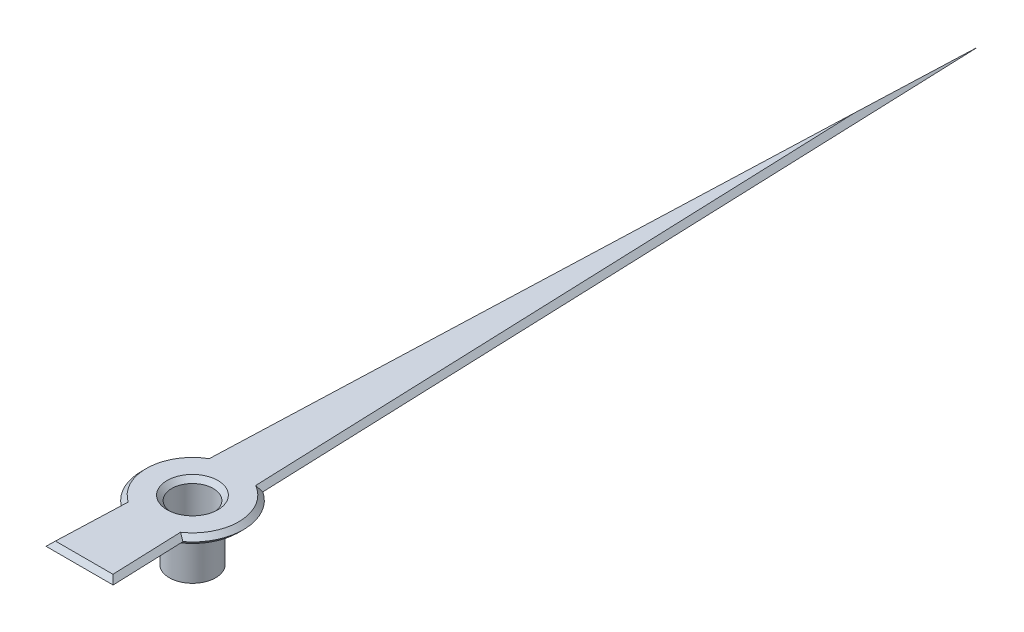
ISO-10303-21;
HEADER;
FILE_DESCRIPTION(('STEP AP214'),'2;1');
FILE_NAME('part.step','',(''),(''),'','','');
FILE_SCHEMA(('AUTOMOTIVE_DESIGN { 1 0 10303 214 1 1 1 1 }'));
ENDSEC;
DATA;
#1=APPLICATION_CONTEXT('core data for automotive mechanical design processes');
#2=APPLICATION_PROTOCOL_DEFINITION('international standard','automotive_design',2000,#1);
#3=PRODUCT_CONTEXT('',#1,'mechanical');
#4=PRODUCT('Part','Part','',(#3));
#5=PRODUCT_RELATED_PRODUCT_CATEGORY('part','',(#4));
#6=PRODUCT_DEFINITION_FORMATION('','',#4);
#7=PRODUCT_DEFINITION_CONTEXT('part definition',#1,'design');
#8=PRODUCT_DEFINITION('design','',#6,#7);
#9=PRODUCT_DEFINITION_SHAPE('','',#8);
#10=(LENGTH_UNIT() NAMED_UNIT(*) SI_UNIT(.MILLI.,.METRE.));
#11=(NAMED_UNIT(*) PLANE_ANGLE_UNIT() SI_UNIT($,.RADIAN.));
#12=(NAMED_UNIT(*) SI_UNIT($,.STERADIAN.) SOLID_ANGLE_UNIT());
#13=UNCERTAINTY_MEASURE_WITH_UNIT(LENGTH_MEASURE(1.E-05),#10,'distance_accuracy_value','');
#14=(GEOMETRIC_REPRESENTATION_CONTEXT(3) GLOBAL_UNCERTAINTY_ASSIGNED_CONTEXT((#13)) GLOBAL_UNIT_ASSIGNED_CONTEXT((#10,
#11,#12)) REPRESENTATION_CONTEXT('',''));
#15=CARTESIAN_POINT('',(0.,0.,0.));
#16=DIRECTION('',(0.,0.,1.));
#17=DIRECTION('',(1.,0.,0.));
#18=AXIS2_PLACEMENT_3D('',#15,#16,#17);
#19=CARTESIAN_POINT('',(0.,0.1,0.));
#20=DIRECTION('',(0.,-1.,0.));
#21=DIRECTION('',(0.,0.,-1.));
#22=AXIS2_PLACEMENT_3D('',#19,#20,#21);
#23=CYLINDRICAL_SURFACE('',#22,0.5);
#24=CARTESIAN_POINT('',(0.,0.,0.));
#25=DIRECTION('',(0.,1.,0.));
#26=DIRECTION('',(0.,0.,1.));
#27=AXIS2_PLACEMENT_3D('',#24,#25,#26);
#28=CIRCLE('',#27,0.5);
#29=CARTESIAN_POINT('',(0.,0.,0.5));
#30=VERTEX_POINT('',#29);
#31=EDGE_CURVE('E307',#30,#30,#28,.F.);
#32=ORIENTED_EDGE('',*,*,#31,.T.);
#33=EDGE_LOOP('',(#32));
#34=FACE_BOUND('',#33,.T.);
#35=CARTESIAN_POINT('',(0.,-1.,0.));
#36=DIRECTION('',(0.,1.,0.));
#37=DIRECTION('',(0.,0.,1.));
#38=AXIS2_PLACEMENT_3D('',#35,#36,#37);
#39=CIRCLE('',#38,0.5);
#40=CARTESIAN_POINT('',(0.,-1.,0.5));
#41=VERTEX_POINT('',#40);
#42=EDGE_CURVE('E330',#41,#41,#39,.T.);
#43=ORIENTED_EDGE('',*,*,#42,.T.);
#44=EDGE_LOOP('',(#43));
#45=FACE_BOUND('',#44,.T.);
#46=ADVANCED_FACE('F35',(#34,#45),#23,.T.);
#47=CARTESIAN_POINT('',(0.,-1.,0.));
#48=DIRECTION('',(0.,1.,0.));
#49=DIRECTION('',(0.,0.,1.));
#50=AXIS2_PLACEMENT_3D('',#47,#48,#49);
#51=PLANE('',#50);
#52=ORIENTED_EDGE('',*,*,#42,.F.);
#53=EDGE_LOOP('',(#52));
#54=FACE_BOUND('',#53,.T.);
#55=ADVANCED_FACE('F179',(#54),#51,.F.);
#56=CARTESIAN_POINT('',(0.,0.1,0.));
#57=DIRECTION('',(0.,1.,0.));
#58=DIRECTION('',(0.,0.,1.));
#59=AXIS2_PLACEMENT_3D('',#56,#57,#58);
#60=PLANE('',#59);
#61=CARTESIAN_POINT('',(0.,0.1,0.));
#62=DIRECTION('',(0.,1.,0.));
#63=DIRECTION('',(0.,0.,1.));
#64=AXIS2_PLACEMENT_3D('',#61,#62,#63);
#65=CIRCLE('',#64,0.600000000000002);
#66=CARTESIAN_POINT('',(0.,0.1,0.600000000000002));
#67=VERTEX_POINT('',#66);
#68=EDGE_CURVE('E304',#67,#67,#65,.T.);
#69=ORIENTED_EDGE('',*,*,#68,.T.);
#70=EDGE_LOOP('',(#69));
#71=FACE_BOUND('',#70,.T.);
#72=DIRECTION('',(-1.,0.,0.));
#73=VECTOR('',#72,1.);
#74=CARTESIAN_POINT('',(-0.726384127954859,0.1,2.34384024813655));
#75=LINE('',#74,#73);
#76=CARTESIAN_POINT('',(0.622578565173561,0.1,2.34384024813655));
#77=VERTEX_POINT('',#76);
#78=CARTESIAN_POINT('',(-0.622578565173561,0.1,2.34384024813655));
#79=VERTEX_POINT('',#78);
#80=EDGE_CURVE('E289',#77,#79,#75,.T.);
#81=ORIENTED_EDGE('',*,*,#80,.T.);
#82=DIRECTION('',(0.0373320171772176,0.,-0.999302917284584));
#83=VECTOR('',#82,1.);
#84=CARTESIAN_POINT('',(-0.567812846983553,0.1,0.877872264283304));
#85=LINE('',#84,#83);
#86=CARTESIAN_POINT('',(-0.565820037420212,0.1,0.824528765570855));
#87=VERTEX_POINT('',#86);
#88=EDGE_CURVE('E296',#79,#87,#85,.T.);
#89=ORIENTED_EDGE('',*,*,#88,.T.);
#90=CARTESIAN_POINT('',(0.,0.1,0.));
#91=DIRECTION('',(0.,1.,0.));
#92=DIRECTION('',(0.,0.,1.));
#93=AXIS2_PLACEMENT_3D('',#90,#91,#92);
#94=CIRCLE('',#93,1.);
#95=CARTESIAN_POINT('',(-0.50272316401545,0.1,-0.864447465357093));
#96=VERTEX_POINT('',#95);
#97=EDGE_CURVE('E326',#87,#96,#94,.F.);
#98=ORIENTED_EDGE('',*,*,#97,.T.);
#99=DIRECTION('',(0.0373320171772176,0.,-0.999302917284584));
#100=VECTOR('',#99,1.);
#101=CARTESIAN_POINT('',(0.0999302917284551,0.1,-16.9962667982823));
#102=LINE('',#101,#100);
#103=CARTESIAN_POINT('',(0.,0.1,-14.3213341372557));
#104=VERTEX_POINT('',#103);
#105=EDGE_CURVE('E329',#96,#104,#102,.T.);
#106=ORIENTED_EDGE('',*,*,#105,.T.);
#107=DIRECTION('',(0.0373320171772176,0.,0.999302917284584));
#108=VECTOR('',#107,1.);
#109=CARTESIAN_POINT('',(0.500730354452136,0.1,-0.917790964069543));
#110=LINE('',#109,#108);
#111=CARTESIAN_POINT('',(0.502723164015464,0.1,-0.864447465357093));
#112=VERTEX_POINT('',#111);
#113=EDGE_CURVE('E298',#104,#112,#110,.T.);
#114=ORIENTED_EDGE('',*,*,#113,.T.);
#115=CARTESIAN_POINT('',(0.,0.1,0.));
#116=DIRECTION('',(0.,1.,0.));
#117=DIRECTION('',(0.,0.,1.));
#118=AXIS2_PLACEMENT_3D('',#115,#116,#117);
#119=CIRCLE('',#118,1.);
#120=CARTESIAN_POINT('',(0.565820037420212,0.1,0.824528765570855));
#121=VERTEX_POINT('',#120);
#122=EDGE_CURVE('E294',#112,#121,#119,.F.);
#123=ORIENTED_EDGE('',*,*,#122,.T.);
#124=DIRECTION('',(0.0373320171772176,0.,0.999302917284584));
#125=VECTOR('',#124,1.);
#126=CARTESIAN_POINT('',(0.626453836226403,0.1,2.44757344985427));
#127=LINE('',#126,#125);
#128=EDGE_CURVE('E291',#121,#77,#127,.T.);
#129=ORIENTED_EDGE('',*,*,#128,.T.);
#130=EDGE_LOOP('',(#81,#89,#98,#106,#114,#123,#129));
#131=FACE_BOUND('',#130,.T.);
#132=ADVANCED_FACE('F186',(#71,#131),#60,.F.);
#133=CARTESIAN_POINT('',(0.,0.3,0.));
#134=DIRECTION('',(0.,1.,0.));
#135=DIRECTION('',(0.,0.,1.));
#136=AXIS2_PLACEMENT_3D('',#133,#134,#135);
#137=PLANE('',#136);
#138=DIRECTION('',(-0.0373320171772176,0.,-0.999302917284584));
#139=VECTOR('',#138,1.);
#140=CARTESIAN_POINT('',(0.534271600717841,0.3,-0.0199593498931194));
#141=LINE('',#140,#139);
#142=CARTESIAN_POINT('',(0.502723164015447,0.3,-0.864447465357091));
#143=VERTEX_POINT('',#142);
#144=CARTESIAN_POINT('',(0.,0.3,-14.3213341372556));
#145=VERTEX_POINT('',#144);
#146=EDGE_CURVE('E58',#143,#145,#141,.T.);
#147=ORIENTED_EDGE('',*,*,#146,.T.);
#148=DIRECTION('',(-0.0373320171772176,0.,0.999302917284584));
#149=VECTOR('',#148,1.);
#150=CARTESIAN_POINT('',(-0.534271600717841,0.3,-0.0199593498931194));
#151=LINE('',#150,#149);
#152=CARTESIAN_POINT('',(-0.502723164015447,0.3,-0.864447465357091));
#153=VERTEX_POINT('',#152);
#154=EDGE_CURVE('E49',#145,#153,#151,.T.);
#155=ORIENTED_EDGE('',*,*,#154,.T.);
#156=CARTESIAN_POINT('',(0.,0.3,0.));
#157=DIRECTION('',(0.,1.,0.));
#158=DIRECTION('',(0.,0.,1.));
#159=AXIS2_PLACEMENT_3D('',#156,#157,#158);
#160=CIRCLE('',#159,1.);
#161=CARTESIAN_POINT('',(-0.565820037420208,0.3,0.824528765570853));
#162=VERTEX_POINT('',#161);
#163=EDGE_CURVE('E312',#153,#162,#160,.T.);
#164=ORIENTED_EDGE('',*,*,#163,.T.);
#165=DIRECTION('',(-0.0373320171772176,0.,0.999302917284584));
#166=VECTOR('',#165,1.);
#167=CARTESIAN_POINT('',(-0.534271600717841,0.3,-0.0199593498931194));
#168=LINE('',#167,#166);
#169=CARTESIAN_POINT('',(-0.622578565173558,0.3,2.34384024813655));
#170=VERTEX_POINT('',#169);
#171=EDGE_CURVE('E314',#162,#170,#168,.T.);
#172=ORIENTED_EDGE('',*,*,#171,.T.);
#173=DIRECTION('',(1.,0.,0.));
#174=VECTOR('',#173,1.);
#175=CARTESIAN_POINT('',(0.,0.3,2.34384024813655));
#176=LINE('',#175,#174);
#177=CARTESIAN_POINT('',(0.622578565173558,0.3,2.34384024813655));
#178=VERTEX_POINT('',#177);
#179=EDGE_CURVE('E133',#170,#178,#176,.T.);
#180=ORIENTED_EDGE('',*,*,#179,.T.);
#181=DIRECTION('',(-0.0373320171772176,0.,-0.999302917284584));
#182=VECTOR('',#181,1.);
#183=CARTESIAN_POINT('',(0.534271600717841,0.3,-0.0199593498931194));
#184=LINE('',#183,#182);
#185=CARTESIAN_POINT('',(0.565820037420222,0.3,0.824528765570852));
#186=VERTEX_POINT('',#185);
#187=EDGE_CURVE('E127',#178,#186,#184,.T.);
#188=ORIENTED_EDGE('',*,*,#187,.T.);
#189=CARTESIAN_POINT('',(0.,0.3,0.));
#190=DIRECTION('',(0.,1.,0.));
#191=DIRECTION('',(0.,0.,1.));
#192=AXIS2_PLACEMENT_3D('',#189,#190,#191);
#193=CIRCLE('',#192,1.);
#194=EDGE_CURVE('E131',#186,#143,#193,.T.);
#195=ORIENTED_EDGE('',*,*,#194,.T.);
#196=EDGE_LOOP('',(#147,#155,#164,#172,#180,#188,#195));
#197=FACE_BOUND('',#196,.T.);
#198=CARTESIAN_POINT('',(0.,0.3,0.));
#199=DIRECTION('',(0.,1.,0.));
#200=DIRECTION('',(0.,0.,1.));
#201=AXIS2_PLACEMENT_3D('',#198,#199,#200);
#202=CIRCLE('',#201,0.549999999999998);
#203=CARTESIAN_POINT('',(0.,0.3,0.549999999999998));
#204=VERTEX_POINT('',#203);
#205=EDGE_CURVE('E309',#204,#204,#202,.F.);
#206=ORIENTED_EDGE('',*,*,#205,.T.);
#207=EDGE_LOOP('',(#206));
#208=FACE_BOUND('',#207,.T.);
#209=ADVANCED_FACE('F129',(#197,#208),#137,.T.);
#210=CARTESIAN_POINT('',(0.,-0.7,0.));
#211=DIRECTION('',(0.,1.,0.));
#212=DIRECTION('',(0.,0.,1.));
#213=AXIS2_PLACEMENT_3D('',#210,#211,#212);
#214=CYLINDRICAL_SURFACE('',#213,0.45);
#215=CARTESIAN_POINT('',(0.,0.200000000000002,0.));
#216=DIRECTION('',(0.,1.,0.));
#217=DIRECTION('',(0.,0.,1.));
#218=AXIS2_PLACEMENT_3D('',#215,#216,#217);
#219=CIRCLE('',#218,0.45);
#220=CARTESIAN_POINT('',(0.,0.200000000000002,0.45));
#221=VERTEX_POINT('',#220);
#222=EDGE_CURVE('E11',#221,#221,#219,.T.);
#223=ORIENTED_EDGE('',*,*,#222,.T.);
#224=EDGE_LOOP('',(#223));
#225=FACE_BOUND('',#224,.T.);
#226=CARTESIAN_POINT('',(0.,-0.7,0.));
#227=DIRECTION('',(0.,1.,0.));
#228=DIRECTION('',(0.,0.,1.));
#229=AXIS2_PLACEMENT_3D('',#226,#227,#228);
#230=CIRCLE('',#229,0.45);
#231=CARTESIAN_POINT('',(0.,-0.7,0.45));
#232=VERTEX_POINT('',#231);
#233=EDGE_CURVE('E349',#232,#232,#230,.T.);
#234=ORIENTED_EDGE('',*,*,#233,.F.);
#235=EDGE_LOOP('',(#234));
#236=FACE_BOUND('',#235,.T.);
#237=ADVANCED_FACE('F337',(#225,#236),#214,.F.);
#238=CARTESIAN_POINT('',(0.,-0.7,0.));
#239=DIRECTION('',(0.,1.,0.));
#240=DIRECTION('',(0.,0.,1.));
#241=AXIS2_PLACEMENT_3D('',#238,#239,#240);
#242=PLANE('',#241);
#243=ORIENTED_EDGE('',*,*,#233,.T.);
#244=EDGE_LOOP('',(#243));
#245=FACE_BOUND('',#244,.T.);
#246=ADVANCED_FACE('F175',(#245),#242,.T.);
#247=CARTESIAN_POINT('',(0.,0.1,0.));
#248=DIRECTION('',(0.,1.,0.));
#249=DIRECTION('',(0.,0.,1.));
#250=AXIS2_PLACEMENT_3D('',#247,#248,#249);
#251=CONICAL_SURFACE('',#250,0.600000000000002,0.785398163397458);
#252=ORIENTED_EDGE('',*,*,#31,.F.);
#253=EDGE_LOOP('',(#252));
#254=FACE_BOUND('',#253,.T.);
#255=ORIENTED_EDGE('',*,*,#68,.F.);
#256=EDGE_LOOP('',(#255));
#257=FACE_BOUND('',#256,.T.);
#258=ADVANCED_FACE('F169',(#254,#257),#251,.T.);
#259=CARTESIAN_POINT('',(0.534271600717841,0.3,-0.0199593498931194));
#260=DIRECTION('',(-0.706613869271422,-0.707106781186555,0.026397722501383));
#261=DIRECTION('',(0.707353280079174,-0.706860196333924,0.));
#262=AXIS2_PLACEMENT_3D('',#259,#260,#261);
#263=PLANE('',#262);
#264=DIRECTION('',(0.,0.0373060299038735,0.999303887780294));
#265=VECTOR('',#264,1.);
#266=CARTESIAN_POINT('',(0.,0.83315612046077,-0.0398631433402992));
#267=LINE('',#266,#265);
#268=CARTESIAN_POINT('',(0.,0.199999999999995,-17.));
#269=VERTEX_POINT('',#268);
#270=EDGE_CURVE('E149',#145,#269,#267,.F.);
#271=ORIENTED_EDGE('',*,*,#270,.F.);
#272=ORIENTED_EDGE('',*,*,#146,.F.);
#273=CARTESIAN_POINT('',(0.600660646180591,0.200000000000002,-0.921524165787265));
#274=CARTESIAN_POINT('',(0.584265274431956,0.216730269616503,-0.912247228072359));
#275=CARTESIAN_POINT('',(0.56790614160859,0.233428727645269,-0.902852373450227));
#276=CARTESIAN_POINT('',(0.535260314043622,0.266762061133618,-0.88382680721478));
#277=CARTESIAN_POINT('',(0.518973619478604,0.283396936438191,-0.874196095026885));
#278=CARTESIAN_POINT('',(0.502723164015439,0.300000000000018,-0.864447465357182));
#279=B_SPLINE_CURVE_WITH_KNOTS('',3,(#273,#274,#275,#276,#277,#278),.UNSPECIFIED.,.F.,.F.,(4,2,
4),(0.,0.0755811298260212,0.151162443796411),.UNSPECIFIED.);
#280=CARTESIAN_POINT('',(0.600660646180591,0.199999999999995,-0.921524165787265));
#281=VERTEX_POINT('',#280);
#282=EDGE_CURVE('E39',#281,#143,#279,.T.);
#283=ORIENTED_EDGE('',*,*,#282,.F.);
#284=DIRECTION('',(0.0373320171772176,0.,0.999302917284584));
#285=VECTOR('',#284,1.);
#286=CARTESIAN_POINT('',(0.,0.200000000000002,-17.));
#287=LINE('',#286,#285);
#288=EDGE_CURVE('E83',#269,#281,#287,.T.);
#289=ORIENTED_EDGE('',*,*,#288,.F.);
#290=EDGE_LOOP('',(#271,#272,#283,#289));
#291=FACE_BOUND('',#290,.T.);
#292=ADVANCED_FACE('F166',(#291),#263,.F.);
#293=CARTESIAN_POINT('',(0.,0.3,0.));
#294=DIRECTION('',(0.,-1.,0.));
#295=DIRECTION('',(0.,0.,-1.));
#296=AXIS2_PLACEMENT_3D('',#293,#294,#295);
#297=CONICAL_SURFACE('',#296,1.,0.785398163397458);
#298=ORIENTED_EDGE('',*,*,#282,.T.);
#299=ORIENTED_EDGE('',*,*,#194,.F.);
#300=CARTESIAN_POINT('',(0.667743138712008,0.200000000000002,0.874139062565583));
#301=CARTESIAN_POINT('',(0.650701295991187,0.216730269616505,0.866111274276081));
#302=CARTESIAN_POINT('',(0.63368679316995,0.233428727645273,0.857963193897874));
#303=CARTESIAN_POINT('',(0.599712425939459,0.266762061133625,0.841426428819148));
#304=CARTESIAN_POINT('',(0.582752561663424,0.2833969364382,0.833037743532474));
#305=CARTESIAN_POINT('',(0.565820037420196,0.300000000000029,0.824528765570939));
#306=B_SPLINE_CURVE_WITH_KNOTS('',3,(#300,#301,#302,#303,#304,#305),.UNSPECIFIED.,.F.,.F.,(4,2,
4),(0.,0.0755811298260294,0.151162443796427),.UNSPECIFIED.);
#307=CARTESIAN_POINT('',(0.667743138712008,0.199999999999995,0.874139062565583));
#308=VERTEX_POINT('',#307);
#309=EDGE_CURVE('E141',#308,#186,#306,.T.);
#310=ORIENTED_EDGE('',*,*,#309,.F.);
#311=CARTESIAN_POINT('',(0.,0.200000000000002,0.));
#312=DIRECTION('',(0.,1.,0.));
#313=DIRECTION('',(0.,0.,1.));
#314=AXIS2_PLACEMENT_3D('',#311,#312,#313);
#315=CIRCLE('',#314,1.1);
#316=EDGE_CURVE('E150',#281,#308,#315,.F.);
#317=ORIENTED_EDGE('',*,*,#316,.F.);
#318=EDGE_LOOP('',(#298,#299,#310,#317));
#319=FACE_BOUND('',#318,.T.);
#320=ADVANCED_FACE('F139',(#319),#297,.T.);
#321=CARTESIAN_POINT('',(0.,0.199999999999995,-17.));
#322=DIRECTION('',(0.706613869271425,-0.707106781186552,-0.0263977225013831));
#323=DIRECTION('',(0.707353280079171,0.706860196333927,0.));
#324=AXIS2_PLACEMENT_3D('',#321,#322,#323);
#325=PLANE('',#324);
#326=DIRECTION('',(0.,-0.0373060299038738,0.999303887780294));
#327=VECTOR('',#326,1.);
#328=CARTESIAN_POINT('',(0.,0.199999999999995,-17.));
#329=LINE('',#328,#327);
#330=EDGE_CURVE('E265',#269,#104,#329,.T.);
#331=ORIENTED_EDGE('',*,*,#330,.F.);
#332=ORIENTED_EDGE('',*,*,#288,.T.);
#333=CARTESIAN_POINT('',(0.600660646180591,0.199999999999995,-0.921524165787265));
#334=CARTESIAN_POINT('',(0.584265274431955,0.183269730383493,-0.912247228072358));
#335=CARTESIAN_POINT('',(0.567906141608588,0.166571272354726,-0.902852373450225));
#336=CARTESIAN_POINT('',(0.535260314043618,0.133237938866374,-0.883826807214777));
#337=CARTESIAN_POINT('',(0.518973619478598,0.1166030635618,-0.874196095026881));
#338=CARTESIAN_POINT('',(0.502723164015432,0.099999999999971,-0.864447465357178));
#339=B_SPLINE_CURVE_WITH_KNOTS('',3,(#333,#334,#335,#336,#337,#338),.UNSPECIFIED.,.F.,.F.,(4,2,
4),(0.,0.075581129826027,0.151162443796423),.UNSPECIFIED.);
#340=EDGE_CURVE('E153',#112,#281,#339,.F.);
#341=ORIENTED_EDGE('',*,*,#340,.F.);
#342=ORIENTED_EDGE('',*,*,#113,.F.);
#343=EDGE_LOOP('',(#331,#332,#341,#342));
#344=FACE_BOUND('',#343,.T.);
#345=ADVANCED_FACE('F174',(#344),#325,.T.);
#346=CARTESIAN_POINT('',(-0.534271600717841,0.3,-0.0199593498931194));
#347=DIRECTION('',(0.706613869271422,-0.707106781186555,0.026397722501383));
#348=DIRECTION('',(0.707353280079174,0.706860196333924,0.));
#349=AXIS2_PLACEMENT_3D('',#346,#347,#348);
#350=PLANE('',#349);
#351=ORIENTED_EDGE('',*,*,#154,.F.);
#352=ORIENTED_EDGE('',*,*,#270,.T.);
#353=DIRECTION('',(0.0373320171772176,0.,-0.999302917284584));
#354=VECTOR('',#353,1.);
#355=CARTESIAN_POINT('',(0.,0.200000000000002,-17.));
#356=LINE('',#355,#354);
#357=CARTESIAN_POINT('',(-0.600660646180591,0.199999999999995,-0.921524165787265));
#358=VERTEX_POINT('',#357);
#359=EDGE_CURVE('E249',#358,#269,#356,.T.);
#360=ORIENTED_EDGE('',*,*,#359,.F.);
#361=CARTESIAN_POINT('',(-0.50272316401546,0.3,-0.864447465357113));
#362=CARTESIAN_POINT('',(-0.518973619478621,0.283396936438176,-0.874196095026827));
#363=CARTESIAN_POINT('',(-0.535260314043632,0.26676206113361,-0.883826807214745));
#364=CARTESIAN_POINT('',(-0.567906141608579,0.233428727645279,-0.902852373450261));
#365=CARTESIAN_POINT('',(-0.58426527443193,0.216730269616526,-0.91224722807244));
#366=CARTESIAN_POINT('',(-0.600660646180547,0.200000000000041,-0.921524165787404));
#367=B_SPLINE_CURVE_WITH_KNOTS('',3,(#361,#362,#363,#364,#365,#366),.UNSPECIFIED.,.F.,.F.,(4,2,
4),(0.,0.0755813139703896,0.151162443796409),.UNSPECIFIED.);
#368=EDGE_CURVE('E241',#153,#358,#367,.T.);
#369=ORIENTED_EDGE('',*,*,#368,.F.);
#370=EDGE_LOOP('',(#351,#352,#360,#369));
#371=FACE_BOUND('',#370,.T.);
#372=ADVANCED_FACE('F165',(#371),#350,.F.);
#373=CARTESIAN_POINT('',(0.534271600717841,0.3,-0.0199593498931194));
#374=DIRECTION('',(-0.706613869271421,-0.707106781186555,0.026397722501383));
#375=DIRECTION('',(0.707353280079175,-0.706860196333923,0.));
#376=AXIS2_PLACEMENT_3D('',#373,#374,#375);
#377=PLANE('',#376);
#378=ORIENTED_EDGE('',*,*,#309,.T.);
#379=ORIENTED_EDGE('',*,*,#187,.F.);
#380=DIRECTION('',(-0.591721567722555,0.5700287651917,-0.570028765191712));
#381=VECTOR('',#380,1.);
#382=CARTESIAN_POINT('',(0.404592384269322,0.509994700730526,2.13384554740602));
#383=LINE('',#382,#381);
#384=CARTESIAN_POINT('',(0.726384127954859,0.199999999999995,2.44384024813655));
#385=VERTEX_POINT('',#384);
#386=EDGE_CURVE('E250',#385,#178,#383,.T.);
#387=ORIENTED_EDGE('',*,*,#386,.F.);
#388=DIRECTION('',(0.0373320171772176,0.,0.999302917284584));
#389=VECTOR('',#388,1.);
#390=CARTESIAN_POINT('',(0.,0.200000000000002,-17.));
#391=LINE('',#390,#389);
#392=EDGE_CURVE('E147',#308,#385,#391,.T.);
#393=ORIENTED_EDGE('',*,*,#392,.F.);
#394=EDGE_LOOP('',(#378,#379,#387,#393));
#395=FACE_BOUND('',#394,.T.);
#396=ADVANCED_FACE('F145',(#395),#377,.F.);
#397=CARTESIAN_POINT('',(0.,0.199999999999995,0.));
#398=DIRECTION('',(0.,1.,0.));
#399=DIRECTION('',(0.,0.,1.));
#400=AXIS2_PLACEMENT_3D('',#397,#398,#399);
#401=CONICAL_SURFACE('',#400,1.1,0.785398163397454);
#402=ORIENTED_EDGE('',*,*,#340,.T.);
#403=ORIENTED_EDGE('',*,*,#316,.T.);
#404=CARTESIAN_POINT('',(0.667743138712008,0.199999999999995,0.874139062565583));
#405=CARTESIAN_POINT('',(0.650701295991189,0.183269730383495,0.866111274276082));
#406=CARTESIAN_POINT('',(0.633686793169955,0.16657127235473,0.857963193897876));
#407=CARTESIAN_POINT('',(0.599712425939468,0.133237938866381,0.841426428819152));
#408=CARTESIAN_POINT('',(0.582752561663437,0.116603063561809,0.83303774353248));
#409=CARTESIAN_POINT('',(0.565820037420211,0.0999999999999819,0.824528765570947));
#410=B_SPLINE_CURVE_WITH_KNOTS('',3,(#404,#405,#406,#407,#408,#409),.UNSPECIFIED.,.F.,.F.,(4,2,
4),(0.,0.0755811298260187,0.151162443796406),.UNSPECIFIED.);
#411=EDGE_CURVE('E273',#121,#308,#410,.F.);
#412=ORIENTED_EDGE('',*,*,#411,.F.);
#413=ORIENTED_EDGE('',*,*,#122,.F.);
#414=EDGE_LOOP('',(#402,#403,#412,#413));
#415=FACE_BOUND('',#414,.T.);
#416=ADVANCED_FACE('F164',(#415),#401,.T.);
#417=CARTESIAN_POINT('',(0.,0.199999999999995,-17.));
#418=DIRECTION('',(-0.706613869271425,-0.707106781186552,-0.0263977225013831));
#419=DIRECTION('',(0.707353280079171,-0.706860196333927,0.));
#420=AXIS2_PLACEMENT_3D('',#417,#418,#419);
#421=PLANE('',#420);
#422=ORIENTED_EDGE('',*,*,#330,.T.);
#423=ORIENTED_EDGE('',*,*,#105,.F.);
#424=CARTESIAN_POINT('',(-0.600660646180591,0.199999999999995,-0.921524165787265));
#425=CARTESIAN_POINT('',(-0.584265274431957,0.183269730383495,-0.912247228072359));
#426=CARTESIAN_POINT('',(-0.567906141608591,0.16657127235473,-0.902852373450227));
#427=CARTESIAN_POINT('',(-0.535260314043625,0.133237938866381,-0.883826807214782));
#428=CARTESIAN_POINT('',(-0.518973619478607,0.116603063561809,-0.874196095026887));
#429=CARTESIAN_POINT('',(-0.502723164015442,0.0999999999999819,-0.864447465357184));
#430=B_SPLINE_CURVE_WITH_KNOTS('',3,(#424,#425,#426,#427,#428,#429),.UNSPECIFIED.,.F.,.F.,(4,2,
4),(0.,0.0755811298260187,0.151162443796406),.UNSPECIFIED.);
#431=EDGE_CURVE('E277',#358,#96,#430,.T.);
#432=ORIENTED_EDGE('',*,*,#431,.F.);
#433=ORIENTED_EDGE('',*,*,#359,.T.);
#434=EDGE_LOOP('',(#422,#423,#432,#433));
#435=FACE_BOUND('',#434,.T.);
#436=ADVANCED_FACE('F235',(#435),#421,.T.);
#437=CARTESIAN_POINT('',(0.,0.3,0.));
#438=DIRECTION('',(0.,-1.,0.));
#439=DIRECTION('',(0.,0.,-1.));
#440=AXIS2_PLACEMENT_3D('',#437,#438,#439);
#441=CONICAL_SURFACE('',#440,1.,0.785398163397458);
#442=ORIENTED_EDGE('',*,*,#163,.F.);
#443=ORIENTED_EDGE('',*,*,#368,.T.);
#444=CARTESIAN_POINT('',(0.,0.200000000000002,0.));
#445=DIRECTION('',(0.,1.,0.));
#446=DIRECTION('',(0.,0.,1.));
#447=AXIS2_PLACEMENT_3D('',#444,#445,#446);
#448=CIRCLE('',#447,1.1);
#449=CARTESIAN_POINT('',(-0.667743138712008,0.199999999999995,0.874139062565583));
#450=VERTEX_POINT('',#449);
#451=EDGE_CURVE('E226',#450,#358,#448,.F.);
#452=ORIENTED_EDGE('',*,*,#451,.F.);
#453=CARTESIAN_POINT('',(-0.667743138712008,0.200000000000002,0.874139062565583));
#454=CARTESIAN_POINT('',(-0.650701295991189,0.216730269616503,0.866111274276082));
#455=CARTESIAN_POINT('',(-0.633686793169954,0.233428727645269,0.857963193897875));
#456=CARTESIAN_POINT('',(-0.599712425939466,0.266762061133618,0.841426428819151));
#457=CARTESIAN_POINT('',(-0.582752561663434,0.283396936438191,0.833037743532478));
#458=CARTESIAN_POINT('',(-0.565820037420207,0.300000000000018,0.824528765570944));
#459=B_SPLINE_CURVE_WITH_KNOTS('',3,(#453,#454,#455,#456,#457,#458),.UNSPECIFIED.,.F.,.F.,(4,2,
4),(0.,0.0755811298260211,0.151162443796411),.UNSPECIFIED.);
#460=EDGE_CURVE('E218',#162,#450,#459,.F.);
#461=ORIENTED_EDGE('',*,*,#460,.F.);
#462=EDGE_LOOP('',(#442,#443,#452,#461));
#463=FACE_BOUND('',#462,.T.);
#464=ADVANCED_FACE('F230',(#463),#441,.T.);
#465=CARTESIAN_POINT('',(0.,0.3,2.34384024813655));
#466=DIRECTION('',(0.,-0.707106781186555,-0.70710678118654));
#467=DIRECTION('',(0.,0.70710678118654,-0.707106781186555));
#468=AXIS2_PLACEMENT_3D('',#465,#466,#467);
#469=PLANE('',#468);
#470=ORIENTED_EDGE('',*,*,#386,.T.);
#471=ORIENTED_EDGE('',*,*,#179,.F.);
#472=DIRECTION('',(0.591721567722555,0.5700287651917,-0.570028765191712));
#473=VECTOR('',#472,1.);
#474=CARTESIAN_POINT('',(0.205646362487406,1.09786179610226,1.54597845203427));
#475=LINE('',#474,#473);
#476=CARTESIAN_POINT('',(-0.726384127954859,0.199999999999995,2.44384024813655));
#477=VERTEX_POINT('',#476);
#478=EDGE_CURVE('E215',#477,#170,#475,.T.);
#479=ORIENTED_EDGE('',*,*,#478,.F.);
#480=DIRECTION('',(-1.,0.,0.));
#481=VECTOR('',#480,1.);
#482=CARTESIAN_POINT('',(-0.726384127954859,0.200000000000002,2.44384024813655));
#483=LINE('',#482,#481);
#484=EDGE_CURVE('E212',#385,#477,#483,.T.);
#485=ORIENTED_EDGE('',*,*,#484,.F.);
#486=EDGE_LOOP('',(#470,#471,#479,#485));
#487=FACE_BOUND('',#486,.T.);
#488=ADVANCED_FACE('F234',(#487),#469,.F.);
#489=CARTESIAN_POINT('',(0.,0.199999999999995,-17.));
#490=DIRECTION('',(0.706613869271424,-0.707106781186552,-0.0263977225013831));
#491=DIRECTION('',(0.707353280079172,0.706860196333926,0.));
#492=AXIS2_PLACEMENT_3D('',#489,#490,#491);
#493=PLANE('',#492);
#494=ORIENTED_EDGE('',*,*,#411,.T.);
#495=ORIENTED_EDGE('',*,*,#392,.T.);
#496=DIRECTION('',(-0.591721567722554,-0.570028765191703,-0.57002876519171));
#497=VECTOR('',#496,1.);
#498=CARTESIAN_POINT('',(-6.08632249759303,-6.3629494634126,-4.11910921527613));
#499=LINE('',#498,#497);
#500=EDGE_CURVE('E207',#77,#385,#499,.F.);
#501=ORIENTED_EDGE('',*,*,#500,.F.);
#502=ORIENTED_EDGE('',*,*,#128,.F.);
#503=EDGE_LOOP('',(#494,#495,#501,#502));
#504=FACE_BOUND('',#503,.T.);
#505=ADVANCED_FACE('F269',(#504),#493,.T.);
#506=CARTESIAN_POINT('',(0.,0.199999999999995,0.));
#507=DIRECTION('',(0.,1.,0.));
#508=DIRECTION('',(0.,0.,1.));
#509=AXIS2_PLACEMENT_3D('',#506,#507,#508);
#510=CONICAL_SURFACE('',#509,1.1,0.785398163397454);
#511=ORIENTED_EDGE('',*,*,#431,.T.);
#512=ORIENTED_EDGE('',*,*,#97,.F.);
#513=CARTESIAN_POINT('',(-0.565820037420226,0.1,0.824528765570876));
#514=CARTESIAN_POINT('',(-0.582752561663449,0.116603063561824,0.833037743532421));
#515=CARTESIAN_POINT('',(-0.599712425939475,0.13323793886639,0.841426428819117));
#516=CARTESIAN_POINT('',(-0.633686793169946,0.166571272354719,0.857963193897911));
#517=CARTESIAN_POINT('',(-0.650701295991169,0.183269730383472,0.866111274276165));
#518=CARTESIAN_POINT('',(-0.667743138711975,0.199999999999957,0.874139062565724));
#519=B_SPLINE_CURVE_WITH_KNOTS('',3,(#513,#514,#515,#516,#517,#518),.UNSPECIFIED.,.F.,.F.,(4,2,
4),(0.,0.0755813139703873,0.151162443796405),.UNSPECIFIED.);
#520=EDGE_CURVE('E94',#450,#87,#519,.F.);
#521=ORIENTED_EDGE('',*,*,#520,.F.);
#522=ORIENTED_EDGE('',*,*,#451,.T.);
#523=EDGE_LOOP('',(#511,#512,#521,#522));
#524=FACE_BOUND('',#523,.T.);
#525=ADVANCED_FACE('F198',(#524),#510,.T.);
#526=CARTESIAN_POINT('',(-0.534271600717841,0.3,-0.0199593498931194));
#527=DIRECTION('',(0.706613869271421,-0.707106781186555,0.026397722501383));
#528=DIRECTION('',(0.707353280079175,0.706860196333923,0.));
#529=AXIS2_PLACEMENT_3D('',#526,#527,#528);
#530=PLANE('',#529);
#531=ORIENTED_EDGE('',*,*,#171,.F.);
#532=ORIENTED_EDGE('',*,*,#460,.T.);
#533=DIRECTION('',(0.0373320171772176,0.,-0.999302917284584));
#534=VECTOR('',#533,1.);
#535=CARTESIAN_POINT('',(0.,0.200000000000002,-17.));
#536=LINE('',#535,#534);
#537=EDGE_CURVE('E208',#477,#450,#536,.T.);
#538=ORIENTED_EDGE('',*,*,#537,.F.);
#539=ORIENTED_EDGE('',*,*,#478,.T.);
#540=EDGE_LOOP('',(#531,#532,#538,#539));
#541=FACE_BOUND('',#540,.T.);
#542=ADVANCED_FACE('F228',(#541),#530,.F.);
#543=CARTESIAN_POINT('',(-0.726384127954859,0.199999999999995,2.44384024813655));
#544=DIRECTION('',(0.,-0.707106781186552,0.707106781186543));
#545=DIRECTION('',(0.,-0.707106781186543,-0.707106781186552));
#546=AXIS2_PLACEMENT_3D('',#543,#544,#545);
#547=PLANE('',#546);
#548=ORIENTED_EDGE('',*,*,#500,.T.);
#549=ORIENTED_EDGE('',*,*,#484,.T.);
#550=DIRECTION('',(0.591721567722554,-0.570028765191703,-0.57002876519171));
#551=VECTOR('',#550,1.);
#552=CARTESIAN_POINT('',(-0.726384127954859,0.199999999999996,2.44384024813655));
#553=LINE('',#552,#551);
#554=EDGE_CURVE('E318',#79,#477,#553,.F.);
#555=ORIENTED_EDGE('',*,*,#554,.F.);
#556=ORIENTED_EDGE('',*,*,#80,.F.);
#557=EDGE_LOOP('',(#548,#549,#555,#556));
#558=FACE_BOUND('',#557,.T.);
#559=ADVANCED_FACE('F197',(#558),#547,.T.);
#560=CARTESIAN_POINT('',(0.,0.199999999999995,-17.));
#561=DIRECTION('',(-0.706613869271424,-0.707106781186552,-0.0263977225013831));
#562=DIRECTION('',(0.707353280079172,-0.706860196333926,0.));
#563=AXIS2_PLACEMENT_3D('',#560,#561,#562);
#564=PLANE('',#563);
#565=ORIENTED_EDGE('',*,*,#520,.T.);
#566=ORIENTED_EDGE('',*,*,#88,.F.);
#567=ORIENTED_EDGE('',*,*,#554,.T.);
#568=ORIENTED_EDGE('',*,*,#537,.T.);
#569=EDGE_LOOP('',(#565,#566,#567,#568));
#570=FACE_BOUND('',#569,.T.);
#571=ADVANCED_FACE('F193',(#570),#564,.T.);
#572=CARTESIAN_POINT('',(0.,0.200000000000002,0.));
#573=DIRECTION('',(0.,1.,0.));
#574=DIRECTION('',(0.,0.,1.));
#575=AXIS2_PLACEMENT_3D('',#572,#573,#574);
#576=CONICAL_SURFACE('',#575,0.45,0.78539816339745);
#577=ORIENTED_EDGE('',*,*,#205,.F.);
#578=EDGE_LOOP('',(#577));
#579=FACE_BOUND('',#578,.T.);
#580=ORIENTED_EDGE('',*,*,#222,.F.);
#581=EDGE_LOOP('',(#580));
#582=FACE_BOUND('',#581,.T.);
#583=ADVANCED_FACE('F37',(#579,#582),#576,.F.);
#584=CLOSED_SHELL('',(#46,#55,#132,#209,#237,#246,#258,#292,#320,#345,#372,#396,#416,#436,#464,
#488,#505,#525,#542,#559,#571,#583));
#585=MANIFOLD_SOLID_BREP('B2',#584);
#586=ADVANCED_BREP_SHAPE_REPRESENTATION('',(#18,#585),#14);
#587=SHAPE_DEFINITION_REPRESENTATION(#9,#586);
ENDSEC;
END-ISO-10303-21;
